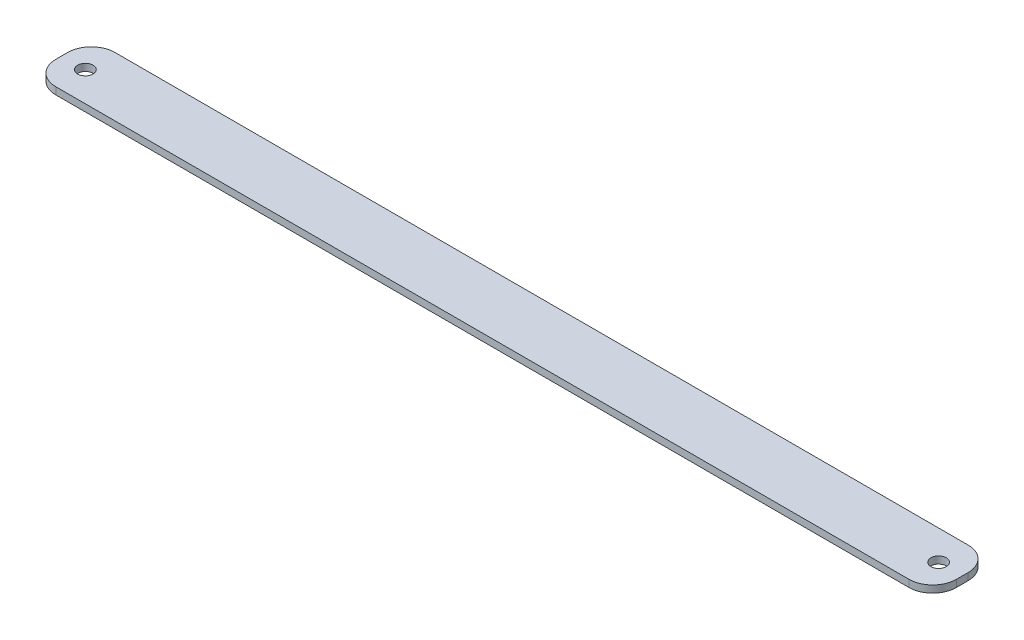
ISO-10303-21;
HEADER;
FILE_DESCRIPTION(('STEP AP214'),'2;1');
FILE_NAME('part.step','',(''),(''),'','','');
FILE_SCHEMA(('AUTOMOTIVE_DESIGN { 1 0 10303 214 1 1 1 1 }'));
ENDSEC;
DATA;
#1=APPLICATION_CONTEXT('core data for automotive mechanical design processes');
#2=APPLICATION_PROTOCOL_DEFINITION('international standard','automotive_design',2000,#1);
#3=PRODUCT_CONTEXT('',#1,'mechanical');
#4=PRODUCT('Part','Part','',(#3));
#5=PRODUCT_RELATED_PRODUCT_CATEGORY('part','',(#4));
#6=PRODUCT_DEFINITION_FORMATION('','',#4);
#7=PRODUCT_DEFINITION_CONTEXT('part definition',#1,'design');
#8=PRODUCT_DEFINITION('design','',#6,#7);
#9=PRODUCT_DEFINITION_SHAPE('','',#8);
#10=(LENGTH_UNIT() NAMED_UNIT(*) SI_UNIT(.MILLI.,.METRE.));
#11=(NAMED_UNIT(*) PLANE_ANGLE_UNIT() SI_UNIT($,.RADIAN.));
#12=(NAMED_UNIT(*) SI_UNIT($,.STERADIAN.) SOLID_ANGLE_UNIT());
#13=UNCERTAINTY_MEASURE_WITH_UNIT(LENGTH_MEASURE(1.E-05),#10,'distance_accuracy_value','');
#14=(GEOMETRIC_REPRESENTATION_CONTEXT(3) GLOBAL_UNCERTAINTY_ASSIGNED_CONTEXT((#13)) GLOBAL_UNIT_ASSIGNED_CONTEXT((#10,
#11,#12)) REPRESENTATION_CONTEXT('',''));
#15=CARTESIAN_POINT('',(0.,0.,0.));
#16=DIRECTION('',(0.,0.,1.));
#17=DIRECTION('',(1.,0.,0.));
#18=AXIS2_PLACEMENT_3D('',#15,#16,#17);
#19=CARTESIAN_POINT('',(180.,3.,2.5));
#20=DIRECTION('',(0.,1.,0.));
#21=DIRECTION('',(0.,0.,1.));
#22=AXIS2_PLACEMENT_3D('',#19,#20,#21);
#23=PLANE('',#22);
#24=CARTESIAN_POINT('',(-180.,3.,0.));
#25=DIRECTION('',(0.,1.,0.));
#26=DIRECTION('',(0.,0.,1.));
#27=AXIS2_PLACEMENT_3D('',#24,#25,#26);
#28=CIRCLE('',#27,3.25000000000001);
#29=CARTESIAN_POINT('',(-180.,3.,3.25000000000001));
#30=VERTEX_POINT('',#29);
#31=EDGE_CURVE('E133',#30,#30,#28,.T.);
#32=ORIENTED_EDGE('',*,*,#31,.F.);
#33=EDGE_LOOP('',(#32));
#34=FACE_BOUND('',#33,.T.);
#35=CARTESIAN_POINT('',(180.,3.,2.5));
#36=DIRECTION('',(0.,1.,0.));
#37=DIRECTION('',(0.,0.,1.));
#38=AXIS2_PLACEMENT_3D('',#35,#36,#37);
#39=CIRCLE('',#38,10.);
#40=CARTESIAN_POINT('',(180.,3.,12.5));
#41=VERTEX_POINT('',#40);
#42=CARTESIAN_POINT('',(190.,3.,2.5));
#43=VERTEX_POINT('',#42);
#44=EDGE_CURVE('E144',#41,#43,#39,.T.);
#45=ORIENTED_EDGE('',*,*,#44,.T.);
#46=DIRECTION('',(0.,0.,-1.));
#47=VECTOR('',#46,1.);
#48=CARTESIAN_POINT('',(190.,3.,-2.5));
#49=LINE('',#48,#47);
#50=CARTESIAN_POINT('',(190.,3.,-2.5));
#51=VERTEX_POINT('',#50);
#52=EDGE_CURVE('E92',#43,#51,#49,.T.);
#53=ORIENTED_EDGE('',*,*,#52,.T.);
#54=CARTESIAN_POINT('',(180.,3.,-2.5));
#55=DIRECTION('',(0.,1.,0.));
#56=DIRECTION('',(0.,0.,1.));
#57=AXIS2_PLACEMENT_3D('',#54,#55,#56);
#58=CIRCLE('',#57,10.);
#59=CARTESIAN_POINT('',(180.,3.,-12.5));
#60=VERTEX_POINT('',#59);
#61=EDGE_CURVE('E159',#51,#60,#58,.T.);
#62=ORIENTED_EDGE('',*,*,#61,.T.);
#63=DIRECTION('',(-1.,0.,0.));
#64=VECTOR('',#63,1.);
#65=CARTESIAN_POINT('',(-180.,3.,-12.5));
#66=LINE('',#65,#64);
#67=CARTESIAN_POINT('',(-180.,3.,-12.5));
#68=VERTEX_POINT('',#67);
#69=EDGE_CURVE('E172',#60,#68,#66,.T.);
#70=ORIENTED_EDGE('',*,*,#69,.T.);
#71=CARTESIAN_POINT('',(-180.,3.,-2.5));
#72=DIRECTION('',(0.,1.,0.));
#73=DIRECTION('',(0.,0.,1.));
#74=AXIS2_PLACEMENT_3D('',#71,#72,#73);
#75=CIRCLE('',#74,10.);
#76=CARTESIAN_POINT('',(-190.,3.,-2.5));
#77=VERTEX_POINT('',#76);
#78=EDGE_CURVE('E111',#68,#77,#75,.T.);
#79=ORIENTED_EDGE('',*,*,#78,.T.);
#80=DIRECTION('',(0.,0.,1.));
#81=VECTOR('',#80,1.);
#82=CARTESIAN_POINT('',(-190.,3.,-2.5));
#83=LINE('',#82,#81);
#84=CARTESIAN_POINT('',(-190.,3.,2.5));
#85=VERTEX_POINT('',#84);
#86=EDGE_CURVE('E105',#77,#85,#83,.T.);
#87=ORIENTED_EDGE('',*,*,#86,.T.);
#88=CARTESIAN_POINT('',(-180.,3.,2.5));
#89=DIRECTION('',(0.,1.,0.));
#90=DIRECTION('',(0.,0.,-1.));
#91=AXIS2_PLACEMENT_3D('',#88,#89,#90);
#92=CIRCLE('',#91,10.);
#93=CARTESIAN_POINT('',(-180.,3.,12.5));
#94=VERTEX_POINT('',#93);
#95=EDGE_CURVE('E109',#85,#94,#92,.T.);
#96=ORIENTED_EDGE('',*,*,#95,.T.);
#97=DIRECTION('',(1.,0.,0.));
#98=VECTOR('',#97,1.);
#99=CARTESIAN_POINT('',(-180.,3.,12.5));
#100=LINE('',#99,#98);
#101=EDGE_CURVE('E49',#94,#41,#100,.T.);
#102=ORIENTED_EDGE('',*,*,#101,.T.);
#103=EDGE_LOOP('',(#45,#53,#62,#70,#79,#87,#96,#102));
#104=FACE_BOUND('',#103,.T.);
#105=CARTESIAN_POINT('',(180.,3.,0.));
#106=DIRECTION('',(0.,1.,0.));
#107=DIRECTION('',(0.,0.,1.));
#108=AXIS2_PLACEMENT_3D('',#105,#106,#107);
#109=CIRCLE('',#108,3.25000000000001);
#110=CARTESIAN_POINT('',(180.,3.,3.25000000000001));
#111=VERTEX_POINT('',#110);
#112=EDGE_CURVE('E181',#111,#111,#109,.T.);
#113=ORIENTED_EDGE('',*,*,#112,.F.);
#114=EDGE_LOOP('',(#113));
#115=FACE_BOUND('',#114,.T.);
#116=ADVANCED_FACE('F32',(#34,#104,#115),#23,.T.);
#117=CARTESIAN_POINT('',(180.,0.,2.5));
#118=DIRECTION('',(0.,1.,0.));
#119=DIRECTION('',(0.,0.,1.));
#120=AXIS2_PLACEMENT_3D('',#117,#118,#119);
#121=PLANE('',#120);
#122=CARTESIAN_POINT('',(180.,0.,2.5));
#123=DIRECTION('',(0.,1.,0.));
#124=DIRECTION('',(0.,0.,1.));
#125=AXIS2_PLACEMENT_3D('',#122,#123,#124);
#126=CIRCLE('',#125,10.);
#127=CARTESIAN_POINT('',(180.,0.,12.5));
#128=VERTEX_POINT('',#127);
#129=CARTESIAN_POINT('',(190.,0.,2.5));
#130=VERTEX_POINT('',#129);
#131=EDGE_CURVE('E129',#128,#130,#126,.T.);
#132=ORIENTED_EDGE('',*,*,#131,.F.);
#133=DIRECTION('',(1.,0.,0.));
#134=VECTOR('',#133,1.);
#135=CARTESIAN_POINT('',(-180.,0.,12.5));
#136=LINE('',#135,#134);
#137=CARTESIAN_POINT('',(-180.,0.,12.5));
#138=VERTEX_POINT('',#137);
#139=EDGE_CURVE('E84',#138,#128,#136,.T.);
#140=ORIENTED_EDGE('',*,*,#139,.F.);
#141=CARTESIAN_POINT('',(-180.,0.,2.5));
#142=DIRECTION('',(0.,1.,0.));
#143=DIRECTION('',(0.,0.,-1.));
#144=AXIS2_PLACEMENT_3D('',#141,#142,#143);
#145=CIRCLE('',#144,10.);
#146=CARTESIAN_POINT('',(-190.,0.,2.5));
#147=VERTEX_POINT('',#146);
#148=EDGE_CURVE('E78',#147,#138,#145,.T.);
#149=ORIENTED_EDGE('',*,*,#148,.F.);
#150=DIRECTION('',(0.,0.,1.));
#151=VECTOR('',#150,1.);
#152=CARTESIAN_POINT('',(-190.,0.,-2.5));
#153=LINE('',#152,#151);
#154=CARTESIAN_POINT('',(-190.,0.,-2.5));
#155=VERTEX_POINT('',#154);
#156=EDGE_CURVE('E119',#155,#147,#153,.T.);
#157=ORIENTED_EDGE('',*,*,#156,.F.);
#158=CARTESIAN_POINT('',(-180.,0.,-2.5));
#159=DIRECTION('',(0.,1.,0.));
#160=DIRECTION('',(0.,0.,1.));
#161=AXIS2_PLACEMENT_3D('',#158,#159,#160);
#162=CIRCLE('',#161,10.);
#163=CARTESIAN_POINT('',(-180.,0.,-12.5));
#164=VERTEX_POINT('',#163);
#165=EDGE_CURVE('E139',#164,#155,#162,.T.);
#166=ORIENTED_EDGE('',*,*,#165,.F.);
#167=DIRECTION('',(-1.,0.,0.));
#168=VECTOR('',#167,1.);
#169=CARTESIAN_POINT('',(-180.,0.,-12.5));
#170=LINE('',#169,#168);
#171=CARTESIAN_POINT('',(180.,0.,-12.5));
#172=VERTEX_POINT('',#171);
#173=EDGE_CURVE('E137',#172,#164,#170,.T.);
#174=ORIENTED_EDGE('',*,*,#173,.F.);
#175=CARTESIAN_POINT('',(180.,0.,-2.5));
#176=DIRECTION('',(0.,1.,0.));
#177=DIRECTION('',(0.,0.,1.));
#178=AXIS2_PLACEMENT_3D('',#175,#176,#177);
#179=CIRCLE('',#178,10.);
#180=CARTESIAN_POINT('',(190.,0.,-2.5));
#181=VERTEX_POINT('',#180);
#182=EDGE_CURVE('E135',#181,#172,#179,.T.);
#183=ORIENTED_EDGE('',*,*,#182,.F.);
#184=DIRECTION('',(0.,0.,-1.));
#185=VECTOR('',#184,1.);
#186=CARTESIAN_POINT('',(190.,0.,-2.5));
#187=LINE('',#186,#185);
#188=EDGE_CURVE('E132',#130,#181,#187,.T.);
#189=ORIENTED_EDGE('',*,*,#188,.F.);
#190=EDGE_LOOP('',(#132,#140,#149,#157,#166,#174,#183,#189));
#191=FACE_BOUND('',#190,.T.);
#192=CARTESIAN_POINT('',(-180.,0.,0.));
#193=DIRECTION('',(0.,1.,0.));
#194=DIRECTION('',(0.,0.,1.));
#195=AXIS2_PLACEMENT_3D('',#192,#193,#194);
#196=CIRCLE('',#195,3.25000000000001);
#197=CARTESIAN_POINT('',(-180.,0.,3.25000000000001));
#198=VERTEX_POINT('',#197);
#199=EDGE_CURVE('E178',#198,#198,#196,.T.);
#200=ORIENTED_EDGE('',*,*,#199,.T.);
#201=EDGE_LOOP('',(#200));
#202=FACE_BOUND('',#201,.T.);
#203=CARTESIAN_POINT('',(180.,0.,0.));
#204=DIRECTION('',(0.,1.,0.));
#205=DIRECTION('',(0.,0.,1.));
#206=AXIS2_PLACEMENT_3D('',#203,#204,#205);
#207=CIRCLE('',#206,3.25000000000001);
#208=CARTESIAN_POINT('',(180.,0.,3.25000000000001));
#209=VERTEX_POINT('',#208);
#210=EDGE_CURVE('E184',#209,#209,#207,.T.);
#211=ORIENTED_EDGE('',*,*,#210,.T.);
#212=EDGE_LOOP('',(#211));
#213=FACE_BOUND('',#212,.T.);
#214=ADVANCED_FACE('F163',(#191,#202,#213),#121,.F.);
#215=CARTESIAN_POINT('',(180.,3.,2.5));
#216=DIRECTION('',(0.,-1.,0.));
#217=DIRECTION('',(0.,0.,-1.));
#218=AXIS2_PLACEMENT_3D('',#215,#216,#217);
#219=CYLINDRICAL_SURFACE('',#218,10.);
#220=ORIENTED_EDGE('',*,*,#131,.T.);
#221=DIRECTION('',(0.,-1.,0.));
#222=VECTOR('',#221,1.);
#223=CARTESIAN_POINT('',(190.,3.,2.5));
#224=LINE('',#223,#222);
#225=EDGE_CURVE('E11',#43,#130,#224,.T.);
#226=ORIENTED_EDGE('',*,*,#225,.F.);
#227=ORIENTED_EDGE('',*,*,#44,.F.);
#228=DIRECTION('',(0.,-1.,0.));
#229=VECTOR('',#228,1.);
#230=CARTESIAN_POINT('',(180.,3.,12.5));
#231=LINE('',#230,#229);
#232=EDGE_CURVE('E125',#41,#128,#231,.T.);
#233=ORIENTED_EDGE('',*,*,#232,.T.);
#234=EDGE_LOOP('',(#220,#226,#227,#233));
#235=FACE_BOUND('',#234,.T.);
#236=ADVANCED_FACE('F34',(#235),#219,.T.);
#237=CARTESIAN_POINT('',(190.,3.,-2.5));
#238=DIRECTION('',(-1.,0.,0.));
#239=DIRECTION('',(0.,0.,1.));
#240=AXIS2_PLACEMENT_3D('',#237,#238,#239);
#241=PLANE('',#240);
#242=ORIENTED_EDGE('',*,*,#188,.T.);
#243=DIRECTION('',(0.,-1.,0.));
#244=VECTOR('',#243,1.);
#245=CARTESIAN_POINT('',(190.,3.,-2.5));
#246=LINE('',#245,#244);
#247=EDGE_CURVE('E41',#51,#181,#246,.T.);
#248=ORIENTED_EDGE('',*,*,#247,.F.);
#249=ORIENTED_EDGE('',*,*,#52,.F.);
#250=ORIENTED_EDGE('',*,*,#225,.T.);
#251=EDGE_LOOP('',(#242,#248,#249,#250));
#252=FACE_BOUND('',#251,.T.);
#253=ADVANCED_FACE('F216',(#252),#241,.F.);
#254=CARTESIAN_POINT('',(180.,3.,-2.5));
#255=DIRECTION('',(0.,-1.,0.));
#256=DIRECTION('',(0.,0.,-1.));
#257=AXIS2_PLACEMENT_3D('',#254,#255,#256);
#258=CYLINDRICAL_SURFACE('',#257,10.);
#259=ORIENTED_EDGE('',*,*,#182,.T.);
#260=DIRECTION('',(0.,-1.,0.));
#261=VECTOR('',#260,1.);
#262=CARTESIAN_POINT('',(180.,3.,-12.5));
#263=LINE('',#262,#261);
#264=EDGE_CURVE('E151',#60,#172,#263,.T.);
#265=ORIENTED_EDGE('',*,*,#264,.F.);
#266=ORIENTED_EDGE('',*,*,#61,.F.);
#267=ORIENTED_EDGE('',*,*,#247,.T.);
#268=EDGE_LOOP('',(#259,#265,#266,#267));
#269=FACE_BOUND('',#268,.T.);
#270=ADVANCED_FACE('F157',(#269),#258,.T.);
#271=CARTESIAN_POINT('',(-180.,3.,-12.5));
#272=DIRECTION('',(0.,0.,1.));
#273=DIRECTION('',(1.,0.,0.));
#274=AXIS2_PLACEMENT_3D('',#271,#272,#273);
#275=PLANE('',#274);
#276=ORIENTED_EDGE('',*,*,#173,.T.);
#277=DIRECTION('',(0.,-1.,0.));
#278=VECTOR('',#277,1.);
#279=CARTESIAN_POINT('',(-180.,3.,-12.5));
#280=LINE('',#279,#278);
#281=EDGE_CURVE('E148',#68,#164,#280,.T.);
#282=ORIENTED_EDGE('',*,*,#281,.F.);
#283=ORIENTED_EDGE('',*,*,#69,.F.);
#284=ORIENTED_EDGE('',*,*,#264,.T.);
#285=EDGE_LOOP('',(#276,#282,#283,#284));
#286=FACE_BOUND('',#285,.T.);
#287=ADVANCED_FACE('F168',(#286),#275,.F.);
#288=CARTESIAN_POINT('',(-180.,3.,-2.5));
#289=DIRECTION('',(0.,-1.,0.));
#290=DIRECTION('',(0.,0.,-1.));
#291=AXIS2_PLACEMENT_3D('',#288,#289,#290);
#292=CYLINDRICAL_SURFACE('',#291,10.);
#293=ORIENTED_EDGE('',*,*,#165,.T.);
#294=DIRECTION('',(0.,-1.,0.));
#295=VECTOR('',#294,1.);
#296=CARTESIAN_POINT('',(-190.,3.,-2.5));
#297=LINE('',#296,#295);
#298=EDGE_CURVE('E120',#77,#155,#297,.T.);
#299=ORIENTED_EDGE('',*,*,#298,.F.);
#300=ORIENTED_EDGE('',*,*,#78,.F.);
#301=ORIENTED_EDGE('',*,*,#281,.T.);
#302=EDGE_LOOP('',(#293,#299,#300,#301));
#303=FACE_BOUND('',#302,.T.);
#304=ADVANCED_FACE('F171',(#303),#292,.T.);
#305=CARTESIAN_POINT('',(-190.,3.,-2.5));
#306=DIRECTION('',(1.,0.,0.));
#307=DIRECTION('',(0.,0.,-1.));
#308=AXIS2_PLACEMENT_3D('',#305,#306,#307);
#309=PLANE('',#308);
#310=ORIENTED_EDGE('',*,*,#156,.T.);
#311=DIRECTION('',(0.,-1.,0.));
#312=VECTOR('',#311,1.);
#313=CARTESIAN_POINT('',(-190.,3.,2.5));
#314=LINE('',#313,#312);
#315=EDGE_CURVE('E116',#85,#147,#314,.T.);
#316=ORIENTED_EDGE('',*,*,#315,.F.);
#317=ORIENTED_EDGE('',*,*,#86,.F.);
#318=ORIENTED_EDGE('',*,*,#298,.T.);
#319=EDGE_LOOP('',(#310,#316,#317,#318));
#320=FACE_BOUND('',#319,.T.);
#321=ADVANCED_FACE('F117',(#320),#309,.F.);
#322=CARTESIAN_POINT('',(-180.,3.,2.5));
#323=DIRECTION('',(0.,-1.,0.));
#324=DIRECTION('',(0.,0.,-1.));
#325=AXIS2_PLACEMENT_3D('',#322,#323,#324);
#326=CYLINDRICAL_SURFACE('',#325,10.);
#327=ORIENTED_EDGE('',*,*,#148,.T.);
#328=DIRECTION('',(0.,-1.,0.));
#329=VECTOR('',#328,1.);
#330=CARTESIAN_POINT('',(-180.,3.,12.5));
#331=LINE('',#330,#329);
#332=EDGE_CURVE('E121',#94,#138,#331,.T.);
#333=ORIENTED_EDGE('',*,*,#332,.F.);
#334=ORIENTED_EDGE('',*,*,#95,.F.);
#335=ORIENTED_EDGE('',*,*,#315,.T.);
#336=EDGE_LOOP('',(#327,#333,#334,#335));
#337=FACE_BOUND('',#336,.T.);
#338=ADVANCED_FACE('F123',(#337),#326,.T.);
#339=CARTESIAN_POINT('',(-180.,3.,12.5));
#340=DIRECTION('',(0.,0.,-1.));
#341=DIRECTION('',(-1.,0.,0.));
#342=AXIS2_PLACEMENT_3D('',#339,#340,#341);
#343=PLANE('',#342);
#344=ORIENTED_EDGE('',*,*,#139,.T.);
#345=ORIENTED_EDGE('',*,*,#232,.F.);
#346=ORIENTED_EDGE('',*,*,#101,.F.);
#347=ORIENTED_EDGE('',*,*,#332,.T.);
#348=EDGE_LOOP('',(#344,#345,#346,#347));
#349=FACE_BOUND('',#348,.T.);
#350=ADVANCED_FACE('F204',(#349),#343,.F.);
#351=CARTESIAN_POINT('',(-180.,3.,0.));
#352=DIRECTION('',(0.,-1.,0.));
#353=DIRECTION('',(0.,0.,-1.));
#354=AXIS2_PLACEMENT_3D('',#351,#352,#353);
#355=CYLINDRICAL_SURFACE('',#354,3.25000000000001);
#356=ORIENTED_EDGE('',*,*,#31,.T.);
#357=EDGE_LOOP('',(#356));
#358=FACE_BOUND('',#357,.T.);
#359=ORIENTED_EDGE('',*,*,#199,.F.);
#360=EDGE_LOOP('',(#359));
#361=FACE_BOUND('',#360,.T.);
#362=ADVANCED_FACE('F201',(#358,#361),#355,.F.);
#363=CARTESIAN_POINT('',(180.,3.,0.));
#364=DIRECTION('',(0.,-1.,0.));
#365=DIRECTION('',(0.,0.,-1.));
#366=AXIS2_PLACEMENT_3D('',#363,#364,#365);
#367=CYLINDRICAL_SURFACE('',#366,3.25000000000001);
#368=ORIENTED_EDGE('',*,*,#112,.T.);
#369=EDGE_LOOP('',(#368));
#370=FACE_BOUND('',#369,.T.);
#371=ORIENTED_EDGE('',*,*,#210,.F.);
#372=EDGE_LOOP('',(#371));
#373=FACE_BOUND('',#372,.T.);
#374=ADVANCED_FACE('F190',(#370,#373),#367,.F.);
#375=CLOSED_SHELL('',(#116,#214,#236,#253,#270,#287,#304,#321,#338,#350,#362,#374));
#376=MANIFOLD_SOLID_BREP('B2',#375);
#377=ADVANCED_BREP_SHAPE_REPRESENTATION('',(#18,#376),#14);
#378=SHAPE_DEFINITION_REPRESENTATION(#9,#377);
ENDSEC;
END-ISO-10303-21;
